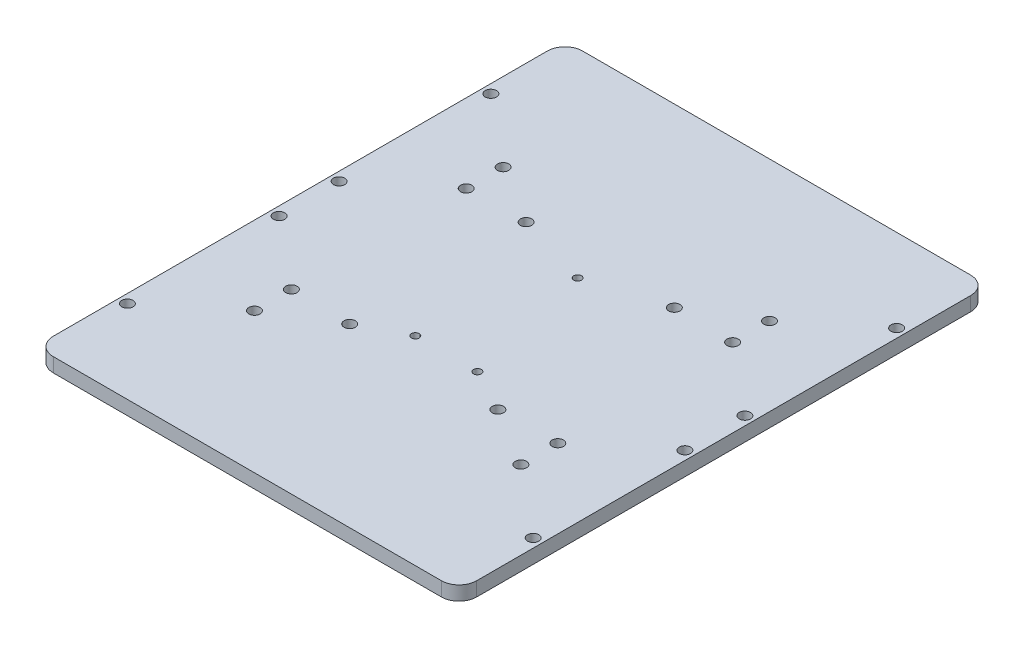
ISO-10303-21;
HEADER;
FILE_DESCRIPTION(('STEP AP214'),'2;1');
FILE_NAME('part.step','',(''),(''),'','','');
FILE_SCHEMA(('AUTOMOTIVE_DESIGN { 1 0 10303 214 1 1 1 1 }'));
ENDSEC;
DATA;
#1=APPLICATION_CONTEXT('core data for automotive mechanical design processes');
#2=APPLICATION_PROTOCOL_DEFINITION('international standard','automotive_design',2000,#1);
#3=PRODUCT_CONTEXT('',#1,'mechanical');
#4=PRODUCT('Part','Part','',(#3));
#5=PRODUCT_RELATED_PRODUCT_CATEGORY('part','',(#4));
#6=PRODUCT_DEFINITION_FORMATION('','',#4);
#7=PRODUCT_DEFINITION_CONTEXT('part definition',#1,'design');
#8=PRODUCT_DEFINITION('design','',#6,#7);
#9=PRODUCT_DEFINITION_SHAPE('','',#8);
#10=(LENGTH_UNIT() NAMED_UNIT(*) SI_UNIT(.MILLI.,.METRE.));
#11=(NAMED_UNIT(*) PLANE_ANGLE_UNIT() SI_UNIT($,.RADIAN.));
#12=(NAMED_UNIT(*) SI_UNIT($,.STERADIAN.) SOLID_ANGLE_UNIT());
#13=UNCERTAINTY_MEASURE_WITH_UNIT(LENGTH_MEASURE(1.E-05),#10,'distance_accuracy_value','');
#14=(GEOMETRIC_REPRESENTATION_CONTEXT(3) GLOBAL_UNCERTAINTY_ASSIGNED_CONTEXT((#13)) GLOBAL_UNIT_ASSIGNED_CONTEXT((#10,
#11,#12)) REPRESENTATION_CONTEXT('',''));
#15=CARTESIAN_POINT('',(0.,0.,0.));
#16=DIRECTION('',(0.,0.,1.));
#17=DIRECTION('',(1.,0.,0.));
#18=AXIS2_PLACEMENT_3D('',#15,#16,#17);
#19=CARTESIAN_POINT('',(0.,4.,0.));
#20=DIRECTION('',(0.,1.,0.));
#21=DIRECTION('',(0.,0.,1.));
#22=AXIS2_PLACEMENT_3D('',#19,#20,#21);
#23=PLANE('',#22);
#24=CARTESIAN_POINT('',(21.,4.,25.));
#25=DIRECTION('',(0.,1.,0.));
#26=DIRECTION('',(0.,0.,1.));
#27=AXIS2_PLACEMENT_3D('',#24,#25,#26);
#28=CIRCLE('',#27,1.6);
#29=CARTESIAN_POINT('',(21.,4.,26.6));
#30=VERTEX_POINT('',#29);
#31=EDGE_CURVE('E304',#30,#30,#28,.T.);
#32=ORIENTED_EDGE('',*,*,#31,.F.);
#33=EDGE_LOOP('',(#32));
#34=FACE_BOUND('',#33,.T.);
#35=CARTESIAN_POINT('',(-21.,4.,-25.));
#36=DIRECTION('',(0.,1.,0.));
#37=DIRECTION('',(0.,0.,1.));
#38=AXIS2_PLACEMENT_3D('',#35,#36,#37);
#39=CIRCLE('',#38,1.6);
#40=CARTESIAN_POINT('',(-21.,4.,-23.4));
#41=VERTEX_POINT('',#40);
#42=EDGE_CURVE('E292',#41,#41,#39,.T.);
#43=ORIENTED_EDGE('',*,*,#42,.F.);
#44=EDGE_LOOP('',(#43));
#45=FACE_BOUND('',#44,.T.);
#46=CARTESIAN_POINT('',(8.8,4.,18.6));
#47=DIRECTION('',(0.,1.,0.));
#48=DIRECTION('',(0.,0.,1.));
#49=AXIS2_PLACEMENT_3D('',#46,#47,#48);
#50=CIRCLE('',#49,1.1);
#51=CARTESIAN_POINT('',(8.8,4.,19.7));
#52=VERTEX_POINT('',#51);
#53=EDGE_CURVE('E280',#52,#52,#50,.T.);
#54=ORIENTED_EDGE('',*,*,#53,.F.);
#55=EDGE_LOOP('',(#54));
#56=FACE_BOUND('',#55,.T.);
#57=CARTESIAN_POINT('',(57.5,4.,-51.5));
#58=DIRECTION('',(0.,1.,0.));
#59=DIRECTION('',(0.,0.,-1.));
#60=AXIS2_PLACEMENT_3D('',#57,#58,#59);
#61=CIRCLE('',#60,1.6);
#62=CARTESIAN_POINT('',(57.5,4.,-53.1));
#63=VERTEX_POINT('',#62);
#64=EDGE_CURVE('E268',#63,#63,#61,.T.);
#65=ORIENTED_EDGE('',*,*,#64,.F.);
#66=EDGE_LOOP('',(#65));
#67=FACE_BOUND('',#66,.T.);
#68=CARTESIAN_POINT('',(37.75,4.,-24.77));
#69=DIRECTION('',(0.,1.,0.));
#70=DIRECTION('',(0.,0.,1.));
#71=AXIS2_PLACEMENT_3D('',#68,#69,#70);
#72=CIRCLE('',#71,1.6);
#73=CARTESIAN_POINT('',(37.75,4.,-23.17));
#74=VERTEX_POINT('',#73);
#75=EDGE_CURVE('E256',#74,#74,#72,.T.);
#76=ORIENTED_EDGE('',*,*,#75,.F.);
#77=EDGE_LOOP('',(#76));
#78=FACE_BOUND('',#77,.T.);
#79=CARTESIAN_POINT('',(57.5,4.,8.50000000000001));
#80=DIRECTION('',(0.,1.,0.));
#81=DIRECTION('',(0.,0.,-1.));
#82=AXIS2_PLACEMENT_3D('',#79,#80,#81);
#83=CIRCLE('',#82,1.6);
#84=CARTESIAN_POINT('',(57.5,4.,6.90000000000001));
#85=VERTEX_POINT('',#84);
#86=EDGE_CURVE('E244',#85,#85,#83,.T.);
#87=ORIENTED_EDGE('',*,*,#86,.F.);
#88=EDGE_LOOP('',(#87));
#89=FACE_BOUND('',#88,.T.);
#90=CARTESIAN_POINT('',(37.75,4.,35.23));
#91=DIRECTION('',(0.,1.,0.));
#92=DIRECTION('',(0.,0.,1.));
#93=AXIS2_PLACEMENT_3D('',#90,#91,#92);
#94=CIRCLE('',#93,1.6);
#95=CARTESIAN_POINT('',(37.75,4.,36.83));
#96=VERTEX_POINT('',#95);
#97=EDGE_CURVE('E232',#96,#96,#94,.T.);
#98=ORIENTED_EDGE('',*,*,#97,.F.);
#99=EDGE_LOOP('',(#98));
#100=FACE_BOUND('',#99,.T.);
#101=CARTESIAN_POINT('',(-57.5,4.,51.5));
#102=DIRECTION('',(0.,1.,0.));
#103=DIRECTION('',(0.,0.,-1.));
#104=AXIS2_PLACEMENT_3D('',#101,#102,#103);
#105=CIRCLE('',#104,1.6);
#106=CARTESIAN_POINT('',(-57.5,4.,49.9));
#107=VERTEX_POINT('',#106);
#108=EDGE_CURVE('E220',#107,#107,#105,.T.);
#109=ORIENTED_EDGE('',*,*,#108,.F.);
#110=EDGE_LOOP('',(#109));
#111=FACE_BOUND('',#110,.T.);
#112=CARTESIAN_POINT('',(-37.75,4.,24.77));
#113=DIRECTION('',(0.,1.,0.));
#114=DIRECTION('',(0.,0.,1.));
#115=AXIS2_PLACEMENT_3D('',#112,#113,#114);
#116=CIRCLE('',#115,1.6);
#117=CARTESIAN_POINT('',(-37.75,4.,26.37));
#118=VERTEX_POINT('',#117);
#119=EDGE_CURVE('E208',#118,#118,#116,.T.);
#120=ORIENTED_EDGE('',*,*,#119,.F.);
#121=EDGE_LOOP('',(#120));
#122=FACE_BOUND('',#121,.T.);
#123=CARTESIAN_POINT('',(-37.75,4.,-24.77));
#124=DIRECTION('',(0.,1.,0.));
#125=DIRECTION('',(0.,0.,-1.));
#126=AXIS2_PLACEMENT_3D('',#123,#124,#125);
#127=CIRCLE('',#126,1.6);
#128=CARTESIAN_POINT('',(-37.75,4.,-26.37));
#129=VERTEX_POINT('',#128);
#130=EDGE_CURVE('E196',#129,#129,#127,.T.);
#131=ORIENTED_EDGE('',*,*,#130,.F.);
#132=EDGE_LOOP('',(#131));
#133=FACE_BOUND('',#132,.T.);
#134=CARTESIAN_POINT('',(-57.5,4.,-8.49999999999999));
#135=DIRECTION('',(0.,1.,0.));
#136=DIRECTION('',(0.,0.,-1.));
#137=AXIS2_PLACEMENT_3D('',#134,#135,#136);
#138=CIRCLE('',#137,1.6);
#139=CARTESIAN_POINT('',(-57.5,4.,-10.1));
#140=VERTEX_POINT('',#139);
#141=EDGE_CURVE('E185',#140,#140,#138,.T.);
#142=ORIENTED_EDGE('',*,*,#141,.F.);
#143=EDGE_LOOP('',(#142));
#144=FACE_BOUND('',#143,.T.);
#145=DIRECTION('',(-1.,0.,0.));
#146=VECTOR('',#145,1.);
#147=CARTESIAN_POINT('',(-60.,4.,-75.));
#148=LINE('',#147,#146);
#149=CARTESIAN_POINT('',(55.,4.,-75.));
#150=VERTEX_POINT('',#149);
#151=CARTESIAN_POINT('',(-55.,4.,-75.));
#152=VERTEX_POINT('',#151);
#153=EDGE_CURVE('E171',#150,#152,#148,.T.);
#154=ORIENTED_EDGE('',*,*,#153,.T.);
#155=CARTESIAN_POINT('',(-55.,4.,-70.));
#156=DIRECTION('',(0.,1.,0.));
#157=DIRECTION('',(0.,0.,1.));
#158=AXIS2_PLACEMENT_3D('',#155,#156,#157);
#159=CIRCLE('',#158,5.);
#160=CARTESIAN_POINT('',(-60.,4.,-70.));
#161=VERTEX_POINT('',#160);
#162=EDGE_CURVE('E149',#152,#161,#159,.T.);
#163=ORIENTED_EDGE('',*,*,#162,.T.);
#164=DIRECTION('',(0.,0.,1.));
#165=VECTOR('',#164,1.);
#166=CARTESIAN_POINT('',(-60.,4.,-75.));
#167=LINE('',#166,#165);
#168=CARTESIAN_POINT('',(-60.,4.,70.));
#169=VERTEX_POINT('',#168);
#170=EDGE_CURVE('E119',#161,#169,#167,.T.);
#171=ORIENTED_EDGE('',*,*,#170,.T.);
#172=CARTESIAN_POINT('',(-55.,4.,70.));
#173=DIRECTION('',(0.,1.,0.));
#174=DIRECTION('',(0.,0.,1.));
#175=AXIS2_PLACEMENT_3D('',#172,#173,#174);
#176=CIRCLE('',#175,5.);
#177=CARTESIAN_POINT('',(-55.,4.,75.));
#178=VERTEX_POINT('',#177);
#179=EDGE_CURVE('E55',#169,#178,#176,.T.);
#180=ORIENTED_EDGE('',*,*,#179,.T.);
#181=DIRECTION('',(1.,0.,0.));
#182=VECTOR('',#181,1.);
#183=CARTESIAN_POINT('',(-60.,4.,75.));
#184=LINE('',#183,#182);
#185=CARTESIAN_POINT('',(55.,4.,75.));
#186=VERTEX_POINT('',#185);
#187=EDGE_CURVE('E135',#178,#186,#184,.T.);
#188=ORIENTED_EDGE('',*,*,#187,.T.);
#189=CARTESIAN_POINT('',(55.,4.,70.));
#190=DIRECTION('',(0.,1.,0.));
#191=DIRECTION('',(0.,0.,1.));
#192=AXIS2_PLACEMENT_3D('',#189,#190,#191);
#193=CIRCLE('',#192,5.);
#194=CARTESIAN_POINT('',(60.,4.,70.));
#195=VERTEX_POINT('',#194);
#196=EDGE_CURVE('E145',#186,#195,#193,.T.);
#197=ORIENTED_EDGE('',*,*,#196,.T.);
#198=DIRECTION('',(0.,0.,-1.));
#199=VECTOR('',#198,1.);
#200=CARTESIAN_POINT('',(60.,4.,-75.));
#201=LINE('',#200,#199);
#202=CARTESIAN_POINT('',(60.,4.,-70.));
#203=VERTEX_POINT('',#202);
#204=EDGE_CURVE('E129',#195,#203,#201,.T.);
#205=ORIENTED_EDGE('',*,*,#204,.T.);
#206=CARTESIAN_POINT('',(55.,4.,-70.));
#207=DIRECTION('',(0.,1.,0.));
#208=DIRECTION('',(0.,0.,1.));
#209=AXIS2_PLACEMENT_3D('',#206,#207,#208);
#210=CIRCLE('',#209,5.);
#211=EDGE_CURVE('E147',#203,#150,#210,.T.);
#212=ORIENTED_EDGE('',*,*,#211,.T.);
#213=EDGE_LOOP('',(#154,#163,#171,#180,#188,#197,#205,#212));
#214=FACE_BOUND('',#213,.T.);
#215=CARTESIAN_POINT('',(-57.5,4.,-51.5));
#216=DIRECTION('',(0.,1.,0.));
#217=DIRECTION('',(0.,0.,1.));
#218=AXIS2_PLACEMENT_3D('',#215,#216,#217);
#219=CIRCLE('',#218,1.6);
#220=CARTESIAN_POINT('',(-57.5,4.,-49.9));
#221=VERTEX_POINT('',#220);
#222=EDGE_CURVE('E180',#221,#221,#219,.T.);
#223=ORIENTED_EDGE('',*,*,#222,.F.);
#224=EDGE_LOOP('',(#223));
#225=FACE_BOUND('',#224,.T.);
#226=CARTESIAN_POINT('',(-37.75,4.,-35.23));
#227=DIRECTION('',(0.,1.,0.));
#228=DIRECTION('',(0.,0.,1.));
#229=AXIS2_PLACEMENT_3D('',#226,#227,#228);
#230=CIRCLE('',#229,1.6);
#231=CARTESIAN_POINT('',(-37.75,4.,-33.63));
#232=VERTEX_POINT('',#231);
#233=EDGE_CURVE('E190',#232,#232,#230,.T.);
#234=ORIENTED_EDGE('',*,*,#233,.F.);
#235=EDGE_LOOP('',(#234));
#236=FACE_BOUND('',#235,.T.);
#237=CARTESIAN_POINT('',(-57.5,4.,8.50000000000001));
#238=DIRECTION('',(0.,1.,0.));
#239=DIRECTION('',(0.,0.,1.));
#240=AXIS2_PLACEMENT_3D('',#237,#238,#239);
#241=CIRCLE('',#240,1.6);
#242=CARTESIAN_POINT('',(-57.5,4.,10.1));
#243=VERTEX_POINT('',#242);
#244=EDGE_CURVE('E202',#243,#243,#241,.T.);
#245=ORIENTED_EDGE('',*,*,#244,.F.);
#246=EDGE_LOOP('',(#245));
#247=FACE_BOUND('',#246,.T.);
#248=CARTESIAN_POINT('',(-37.75,4.,35.23));
#249=DIRECTION('',(0.,1.,0.));
#250=DIRECTION('',(0.,0.,-1.));
#251=AXIS2_PLACEMENT_3D('',#248,#249,#250);
#252=CIRCLE('',#251,1.6);
#253=CARTESIAN_POINT('',(-37.75,4.,33.63));
#254=VERTEX_POINT('',#253);
#255=EDGE_CURVE('E214',#254,#254,#252,.T.);
#256=ORIENTED_EDGE('',*,*,#255,.F.);
#257=EDGE_LOOP('',(#256));
#258=FACE_BOUND('',#257,.T.);
#259=CARTESIAN_POINT('',(57.5,4.,51.5));
#260=DIRECTION('',(0.,1.,0.));
#261=DIRECTION('',(0.,0.,1.));
#262=AXIS2_PLACEMENT_3D('',#259,#260,#261);
#263=CIRCLE('',#262,1.6);
#264=CARTESIAN_POINT('',(57.5,4.,53.1));
#265=VERTEX_POINT('',#264);
#266=EDGE_CURVE('E226',#265,#265,#263,.T.);
#267=ORIENTED_EDGE('',*,*,#266,.F.);
#268=EDGE_LOOP('',(#267));
#269=FACE_BOUND('',#268,.T.);
#270=CARTESIAN_POINT('',(37.75,4.,24.77));
#271=DIRECTION('',(0.,1.,0.));
#272=DIRECTION('',(0.,0.,-1.));
#273=AXIS2_PLACEMENT_3D('',#270,#271,#272);
#274=CIRCLE('',#273,1.6);
#275=CARTESIAN_POINT('',(37.75,4.,23.17));
#276=VERTEX_POINT('',#275);
#277=EDGE_CURVE('E238',#276,#276,#274,.T.);
#278=ORIENTED_EDGE('',*,*,#277,.F.);
#279=EDGE_LOOP('',(#278));
#280=FACE_BOUND('',#279,.T.);
#281=CARTESIAN_POINT('',(57.5,4.,-8.50000000000002));
#282=DIRECTION('',(0.,1.,0.));
#283=DIRECTION('',(0.,0.,1.));
#284=AXIS2_PLACEMENT_3D('',#281,#282,#283);
#285=CIRCLE('',#284,1.6);
#286=CARTESIAN_POINT('',(57.5,4.,-6.90000000000002));
#287=VERTEX_POINT('',#286);
#288=EDGE_CURVE('E250',#287,#287,#285,.T.);
#289=ORIENTED_EDGE('',*,*,#288,.F.);
#290=EDGE_LOOP('',(#289));
#291=FACE_BOUND('',#290,.T.);
#292=CARTESIAN_POINT('',(37.75,4.,-35.23));
#293=DIRECTION('',(0.,1.,0.));
#294=DIRECTION('',(0.,0.,-1.));
#295=AXIS2_PLACEMENT_3D('',#292,#293,#294);
#296=CIRCLE('',#295,1.6);
#297=CARTESIAN_POINT('',(37.75,4.,-36.83));
#298=VERTEX_POINT('',#297);
#299=EDGE_CURVE('E262',#298,#298,#296,.T.);
#300=ORIENTED_EDGE('',*,*,#299,.F.);
#301=EDGE_LOOP('',(#300));
#302=FACE_BOUND('',#301,.T.);
#303=CARTESIAN_POINT('',(0.,4.,-18.6));
#304=DIRECTION('',(0.,1.,0.));
#305=DIRECTION('',(0.,0.,1.));
#306=AXIS2_PLACEMENT_3D('',#303,#304,#305);
#307=CIRCLE('',#306,1.1);
#308=CARTESIAN_POINT('',(0.,4.,-17.5));
#309=VERTEX_POINT('',#308);
#310=EDGE_CURVE('E274',#309,#309,#307,.T.);
#311=ORIENTED_EDGE('',*,*,#310,.F.);
#312=EDGE_LOOP('',(#311));
#313=FACE_BOUND('',#312,.T.);
#314=CARTESIAN_POINT('',(-8.8,4.,18.6));
#315=DIRECTION('',(0.,1.,0.));
#316=DIRECTION('',(0.,0.,1.));
#317=AXIS2_PLACEMENT_3D('',#314,#315,#316);
#318=CIRCLE('',#317,1.1);
#319=CARTESIAN_POINT('',(-8.8,4.,19.7));
#320=VERTEX_POINT('',#319);
#321=EDGE_CURVE('E286',#320,#320,#318,.T.);
#322=ORIENTED_EDGE('',*,*,#321,.F.);
#323=EDGE_LOOP('',(#322));
#324=FACE_BOUND('',#323,.T.);
#325=CARTESIAN_POINT('',(21.,4.,-25.));
#326=DIRECTION('',(0.,1.,0.));
#327=DIRECTION('',(0.,0.,-1.));
#328=AXIS2_PLACEMENT_3D('',#325,#326,#327);
#329=CIRCLE('',#328,1.6);
#330=CARTESIAN_POINT('',(21.,4.,-26.6));
#331=VERTEX_POINT('',#330);
#332=EDGE_CURVE('E298',#331,#331,#329,.T.);
#333=ORIENTED_EDGE('',*,*,#332,.F.);
#334=EDGE_LOOP('',(#333));
#335=FACE_BOUND('',#334,.T.);
#336=CARTESIAN_POINT('',(-21.,4.,25.));
#337=DIRECTION('',(0.,1.,0.));
#338=DIRECTION('',(0.,0.,-1.));
#339=AXIS2_PLACEMENT_3D('',#336,#337,#338);
#340=CIRCLE('',#339,1.6);
#341=CARTESIAN_POINT('',(-21.,4.,23.4));
#342=VERTEX_POINT('',#341);
#343=EDGE_CURVE('E310',#342,#342,#340,.T.);
#344=ORIENTED_EDGE('',*,*,#343,.F.);
#345=EDGE_LOOP('',(#344));
#346=FACE_BOUND('',#345,.T.);
#347=ADVANCED_FACE('F35',(#34,#45,#56,#67,#78,#89,#100,#111,#122,#133,#144,#214,#225,#236,#247,
#258,#269,#280,#291,#302,#313,#324,#335,#346),#23,.T.);
#348=CARTESIAN_POINT('',(0.,0.,0.));
#349=DIRECTION('',(0.,1.,0.));
#350=DIRECTION('',(0.,0.,1.));
#351=AXIS2_PLACEMENT_3D('',#348,#349,#350);
#352=PLANE('',#351);
#353=DIRECTION('',(0.,0.,1.));
#354=VECTOR('',#353,1.);
#355=CARTESIAN_POINT('',(-60.,0.,-75.));
#356=LINE('',#355,#354);
#357=CARTESIAN_POINT('',(-60.,0.,-70.));
#358=VERTEX_POINT('',#357);
#359=CARTESIAN_POINT('',(-60.,0.,70.));
#360=VERTEX_POINT('',#359);
#361=EDGE_CURVE('E117',#358,#360,#356,.T.);
#362=ORIENTED_EDGE('',*,*,#361,.F.);
#363=CARTESIAN_POINT('',(-55.,0.,-70.));
#364=DIRECTION('',(0.,1.,0.));
#365=DIRECTION('',(0.,0.,1.));
#366=AXIS2_PLACEMENT_3D('',#363,#364,#365);
#367=CIRCLE('',#366,5.);
#368=CARTESIAN_POINT('',(-55.,0.,-75.));
#369=VERTEX_POINT('',#368);
#370=EDGE_CURVE('E100',#358,#369,#367,.F.);
#371=ORIENTED_EDGE('',*,*,#370,.T.);
#372=DIRECTION('',(-1.,0.,0.));
#373=VECTOR('',#372,1.);
#374=CARTESIAN_POINT('',(-60.,0.,-75.));
#375=LINE('',#374,#373);
#376=CARTESIAN_POINT('',(55.,0.,-75.));
#377=VERTEX_POINT('',#376);
#378=EDGE_CURVE('E127',#377,#369,#375,.T.);
#379=ORIENTED_EDGE('',*,*,#378,.F.);
#380=CARTESIAN_POINT('',(55.,0.,-70.));
#381=DIRECTION('',(0.,1.,0.));
#382=DIRECTION('',(0.,0.,1.));
#383=AXIS2_PLACEMENT_3D('',#380,#381,#382);
#384=CIRCLE('',#383,5.);
#385=CARTESIAN_POINT('',(60.,0.,-70.));
#386=VERTEX_POINT('',#385);
#387=EDGE_CURVE('E111',#377,#386,#384,.F.);
#388=ORIENTED_EDGE('',*,*,#387,.T.);
#389=DIRECTION('',(0.,0.,-1.));
#390=VECTOR('',#389,1.);
#391=CARTESIAN_POINT('',(60.,0.,-75.));
#392=LINE('',#391,#390);
#393=CARTESIAN_POINT('',(60.,0.,70.));
#394=VERTEX_POINT('',#393);
#395=EDGE_CURVE('E131',#394,#386,#392,.T.);
#396=ORIENTED_EDGE('',*,*,#395,.F.);
#397=CARTESIAN_POINT('',(55.,0.,70.));
#398=DIRECTION('',(0.,1.,0.));
#399=DIRECTION('',(0.,0.,1.));
#400=AXIS2_PLACEMENT_3D('',#397,#398,#399);
#401=CIRCLE('',#400,5.);
#402=CARTESIAN_POINT('',(55.,0.,75.));
#403=VERTEX_POINT('',#402);
#404=EDGE_CURVE('E138',#394,#403,#401,.F.);
#405=ORIENTED_EDGE('',*,*,#404,.T.);
#406=DIRECTION('',(1.,0.,0.));
#407=VECTOR('',#406,1.);
#408=CARTESIAN_POINT('',(-60.,0.,75.));
#409=LINE('',#408,#407);
#410=CARTESIAN_POINT('',(-55.,0.,75.));
#411=VERTEX_POINT('',#410);
#412=EDGE_CURVE('E126',#411,#403,#409,.T.);
#413=ORIENTED_EDGE('',*,*,#412,.F.);
#414=CARTESIAN_POINT('',(-55.,0.,70.));
#415=DIRECTION('',(0.,1.,0.));
#416=DIRECTION('',(0.,0.,1.));
#417=AXIS2_PLACEMENT_3D('',#414,#415,#416);
#418=CIRCLE('',#417,5.);
#419=EDGE_CURVE('E120',#411,#360,#418,.F.);
#420=ORIENTED_EDGE('',*,*,#419,.T.);
#421=EDGE_LOOP('',(#362,#371,#379,#388,#396,#405,#413,#420));
#422=FACE_BOUND('',#421,.T.);
#423=CARTESIAN_POINT('',(-57.5,0.,-51.5));
#424=DIRECTION('',(0.,1.,0.));
#425=DIRECTION('',(0.,0.,1.));
#426=AXIS2_PLACEMENT_3D('',#423,#424,#425);
#427=CIRCLE('',#426,1.6);
#428=CARTESIAN_POINT('',(-57.5,0.,-49.9));
#429=VERTEX_POINT('',#428);
#430=EDGE_CURVE('E176',#429,#429,#427,.T.);
#431=ORIENTED_EDGE('',*,*,#430,.T.);
#432=EDGE_LOOP('',(#431));
#433=FACE_BOUND('',#432,.T.);
#434=CARTESIAN_POINT('',(-57.5,0.,-8.49999999999999));
#435=DIRECTION('',(0.,1.,0.));
#436=DIRECTION('',(0.,0.,-1.));
#437=AXIS2_PLACEMENT_3D('',#434,#435,#436);
#438=CIRCLE('',#437,1.6);
#439=CARTESIAN_POINT('',(-57.5,0.,-10.1));
#440=VERTEX_POINT('',#439);
#441=EDGE_CURVE('E187',#440,#440,#438,.T.);
#442=ORIENTED_EDGE('',*,*,#441,.T.);
#443=EDGE_LOOP('',(#442));
#444=FACE_BOUND('',#443,.T.);
#445=CARTESIAN_POINT('',(-37.75,0.,-35.23));
#446=DIRECTION('',(0.,1.,0.));
#447=DIRECTION('',(0.,0.,1.));
#448=AXIS2_PLACEMENT_3D('',#445,#446,#447);
#449=CIRCLE('',#448,1.6);
#450=CARTESIAN_POINT('',(-37.75,0.,-33.63));
#451=VERTEX_POINT('',#450);
#452=EDGE_CURVE('E193',#451,#451,#449,.T.);
#453=ORIENTED_EDGE('',*,*,#452,.T.);
#454=EDGE_LOOP('',(#453));
#455=FACE_BOUND('',#454,.T.);
#456=CARTESIAN_POINT('',(-37.75,0.,-24.77));
#457=DIRECTION('',(0.,1.,0.));
#458=DIRECTION('',(0.,0.,-1.));
#459=AXIS2_PLACEMENT_3D('',#456,#457,#458);
#460=CIRCLE('',#459,1.6);
#461=CARTESIAN_POINT('',(-37.75,0.,-26.37));
#462=VERTEX_POINT('',#461);
#463=EDGE_CURVE('E199',#462,#462,#460,.T.);
#464=ORIENTED_EDGE('',*,*,#463,.T.);
#465=EDGE_LOOP('',(#464));
#466=FACE_BOUND('',#465,.T.);
#467=CARTESIAN_POINT('',(-57.5,0.,8.50000000000001));
#468=DIRECTION('',(0.,1.,0.));
#469=DIRECTION('',(0.,0.,1.));
#470=AXIS2_PLACEMENT_3D('',#467,#468,#469);
#471=CIRCLE('',#470,1.6);
#472=CARTESIAN_POINT('',(-57.5,0.,10.1));
#473=VERTEX_POINT('',#472);
#474=EDGE_CURVE('E205',#473,#473,#471,.T.);
#475=ORIENTED_EDGE('',*,*,#474,.T.);
#476=EDGE_LOOP('',(#475));
#477=FACE_BOUND('',#476,.T.);
#478=CARTESIAN_POINT('',(-37.75,0.,24.77));
#479=DIRECTION('',(0.,1.,0.));
#480=DIRECTION('',(0.,0.,1.));
#481=AXIS2_PLACEMENT_3D('',#478,#479,#480);
#482=CIRCLE('',#481,1.6);
#483=CARTESIAN_POINT('',(-37.75,0.,26.37));
#484=VERTEX_POINT('',#483);
#485=EDGE_CURVE('E211',#484,#484,#482,.T.);
#486=ORIENTED_EDGE('',*,*,#485,.T.);
#487=EDGE_LOOP('',(#486));
#488=FACE_BOUND('',#487,.T.);
#489=CARTESIAN_POINT('',(-37.75,0.,35.23));
#490=DIRECTION('',(0.,1.,0.));
#491=DIRECTION('',(0.,0.,-1.));
#492=AXIS2_PLACEMENT_3D('',#489,#490,#491);
#493=CIRCLE('',#492,1.6);
#494=CARTESIAN_POINT('',(-37.75,0.,33.63));
#495=VERTEX_POINT('',#494);
#496=EDGE_CURVE('E217',#495,#495,#493,.T.);
#497=ORIENTED_EDGE('',*,*,#496,.T.);
#498=EDGE_LOOP('',(#497));
#499=FACE_BOUND('',#498,.T.);
#500=CARTESIAN_POINT('',(-57.5,0.,51.5));
#501=DIRECTION('',(0.,1.,0.));
#502=DIRECTION('',(0.,0.,-1.));
#503=AXIS2_PLACEMENT_3D('',#500,#501,#502);
#504=CIRCLE('',#503,1.6);
#505=CARTESIAN_POINT('',(-57.5,0.,49.9));
#506=VERTEX_POINT('',#505);
#507=EDGE_CURVE('E223',#506,#506,#504,.T.);
#508=ORIENTED_EDGE('',*,*,#507,.T.);
#509=EDGE_LOOP('',(#508));
#510=FACE_BOUND('',#509,.T.);
#511=CARTESIAN_POINT('',(57.5,0.,51.5));
#512=DIRECTION('',(0.,1.,0.));
#513=DIRECTION('',(0.,0.,1.));
#514=AXIS2_PLACEMENT_3D('',#511,#512,#513);
#515=CIRCLE('',#514,1.6);
#516=CARTESIAN_POINT('',(57.5,0.,53.1));
#517=VERTEX_POINT('',#516);
#518=EDGE_CURVE('E229',#517,#517,#515,.T.);
#519=ORIENTED_EDGE('',*,*,#518,.T.);
#520=EDGE_LOOP('',(#519));
#521=FACE_BOUND('',#520,.T.);
#522=CARTESIAN_POINT('',(37.75,0.,35.23));
#523=DIRECTION('',(0.,1.,0.));
#524=DIRECTION('',(0.,0.,1.));
#525=AXIS2_PLACEMENT_3D('',#522,#523,#524);
#526=CIRCLE('',#525,1.6);
#527=CARTESIAN_POINT('',(37.75,0.,36.83));
#528=VERTEX_POINT('',#527);
#529=EDGE_CURVE('E235',#528,#528,#526,.T.);
#530=ORIENTED_EDGE('',*,*,#529,.T.);
#531=EDGE_LOOP('',(#530));
#532=FACE_BOUND('',#531,.T.);
#533=CARTESIAN_POINT('',(37.75,0.,24.77));
#534=DIRECTION('',(0.,1.,0.));
#535=DIRECTION('',(0.,0.,-1.));
#536=AXIS2_PLACEMENT_3D('',#533,#534,#535);
#537=CIRCLE('',#536,1.6);
#538=CARTESIAN_POINT('',(37.75,0.,23.17));
#539=VERTEX_POINT('',#538);
#540=EDGE_CURVE('E241',#539,#539,#537,.T.);
#541=ORIENTED_EDGE('',*,*,#540,.T.);
#542=EDGE_LOOP('',(#541));
#543=FACE_BOUND('',#542,.T.);
#544=CARTESIAN_POINT('',(57.5,0.,8.50000000000001));
#545=DIRECTION('',(0.,1.,0.));
#546=DIRECTION('',(0.,0.,-1.));
#547=AXIS2_PLACEMENT_3D('',#544,#545,#546);
#548=CIRCLE('',#547,1.6);
#549=CARTESIAN_POINT('',(57.5,0.,6.90000000000001));
#550=VERTEX_POINT('',#549);
#551=EDGE_CURVE('E247',#550,#550,#548,.T.);
#552=ORIENTED_EDGE('',*,*,#551,.T.);
#553=EDGE_LOOP('',(#552));
#554=FACE_BOUND('',#553,.T.);
#555=CARTESIAN_POINT('',(57.5,0.,-8.50000000000002));
#556=DIRECTION('',(0.,1.,0.));
#557=DIRECTION('',(0.,0.,1.));
#558=AXIS2_PLACEMENT_3D('',#555,#556,#557);
#559=CIRCLE('',#558,1.6);
#560=CARTESIAN_POINT('',(57.5,0.,-6.90000000000002));
#561=VERTEX_POINT('',#560);
#562=EDGE_CURVE('E253',#561,#561,#559,.T.);
#563=ORIENTED_EDGE('',*,*,#562,.T.);
#564=EDGE_LOOP('',(#563));
#565=FACE_BOUND('',#564,.T.);
#566=CARTESIAN_POINT('',(37.75,0.,-24.77));
#567=DIRECTION('',(0.,1.,0.));
#568=DIRECTION('',(0.,0.,1.));
#569=AXIS2_PLACEMENT_3D('',#566,#567,#568);
#570=CIRCLE('',#569,1.6);
#571=CARTESIAN_POINT('',(37.75,0.,-23.17));
#572=VERTEX_POINT('',#571);
#573=EDGE_CURVE('E259',#572,#572,#570,.T.);
#574=ORIENTED_EDGE('',*,*,#573,.T.);
#575=EDGE_LOOP('',(#574));
#576=FACE_BOUND('',#575,.T.);
#577=CARTESIAN_POINT('',(37.75,0.,-35.23));
#578=DIRECTION('',(0.,1.,0.));
#579=DIRECTION('',(0.,0.,-1.));
#580=AXIS2_PLACEMENT_3D('',#577,#578,#579);
#581=CIRCLE('',#580,1.6);
#582=CARTESIAN_POINT('',(37.75,0.,-36.83));
#583=VERTEX_POINT('',#582);
#584=EDGE_CURVE('E265',#583,#583,#581,.T.);
#585=ORIENTED_EDGE('',*,*,#584,.T.);
#586=EDGE_LOOP('',(#585));
#587=FACE_BOUND('',#586,.T.);
#588=CARTESIAN_POINT('',(57.5,0.,-51.5));
#589=DIRECTION('',(0.,1.,0.));
#590=DIRECTION('',(0.,0.,-1.));
#591=AXIS2_PLACEMENT_3D('',#588,#589,#590);
#592=CIRCLE('',#591,1.6);
#593=CARTESIAN_POINT('',(57.5,0.,-53.1));
#594=VERTEX_POINT('',#593);
#595=EDGE_CURVE('E271',#594,#594,#592,.T.);
#596=ORIENTED_EDGE('',*,*,#595,.T.);
#597=EDGE_LOOP('',(#596));
#598=FACE_BOUND('',#597,.T.);
#599=CARTESIAN_POINT('',(0.,0.,-18.6));
#600=DIRECTION('',(0.,1.,0.));
#601=DIRECTION('',(0.,0.,1.));
#602=AXIS2_PLACEMENT_3D('',#599,#600,#601);
#603=CIRCLE('',#602,1.1);
#604=CARTESIAN_POINT('',(0.,0.,-17.5));
#605=VERTEX_POINT('',#604);
#606=EDGE_CURVE('E277',#605,#605,#603,.T.);
#607=ORIENTED_EDGE('',*,*,#606,.T.);
#608=EDGE_LOOP('',(#607));
#609=FACE_BOUND('',#608,.T.);
#610=CARTESIAN_POINT('',(8.8,0.,18.6));
#611=DIRECTION('',(0.,1.,0.));
#612=DIRECTION('',(0.,0.,1.));
#613=AXIS2_PLACEMENT_3D('',#610,#611,#612);
#614=CIRCLE('',#613,1.1);
#615=CARTESIAN_POINT('',(8.8,0.,19.7));
#616=VERTEX_POINT('',#615);
#617=EDGE_CURVE('E283',#616,#616,#614,.T.);
#618=ORIENTED_EDGE('',*,*,#617,.T.);
#619=EDGE_LOOP('',(#618));
#620=FACE_BOUND('',#619,.T.);
#621=CARTESIAN_POINT('',(-8.8,0.,18.6));
#622=DIRECTION('',(0.,1.,0.));
#623=DIRECTION('',(0.,0.,1.));
#624=AXIS2_PLACEMENT_3D('',#621,#622,#623);
#625=CIRCLE('',#624,1.1);
#626=CARTESIAN_POINT('',(-8.8,0.,19.7));
#627=VERTEX_POINT('',#626);
#628=EDGE_CURVE('E289',#627,#627,#625,.T.);
#629=ORIENTED_EDGE('',*,*,#628,.T.);
#630=EDGE_LOOP('',(#629));
#631=FACE_BOUND('',#630,.T.);
#632=CARTESIAN_POINT('',(-21.,0.,-25.));
#633=DIRECTION('',(0.,1.,0.));
#634=DIRECTION('',(0.,0.,1.));
#635=AXIS2_PLACEMENT_3D('',#632,#633,#634);
#636=CIRCLE('',#635,1.6);
#637=CARTESIAN_POINT('',(-21.,0.,-23.4));
#638=VERTEX_POINT('',#637);
#639=EDGE_CURVE('E295',#638,#638,#636,.T.);
#640=ORIENTED_EDGE('',*,*,#639,.T.);
#641=EDGE_LOOP('',(#640));
#642=FACE_BOUND('',#641,.T.);
#643=CARTESIAN_POINT('',(21.,0.,-25.));
#644=DIRECTION('',(0.,1.,0.));
#645=DIRECTION('',(0.,0.,-1.));
#646=AXIS2_PLACEMENT_3D('',#643,#644,#645);
#647=CIRCLE('',#646,1.6);
#648=CARTESIAN_POINT('',(21.,0.,-26.6));
#649=VERTEX_POINT('',#648);
#650=EDGE_CURVE('E301',#649,#649,#647,.T.);
#651=ORIENTED_EDGE('',*,*,#650,.T.);
#652=EDGE_LOOP('',(#651));
#653=FACE_BOUND('',#652,.T.);
#654=CARTESIAN_POINT('',(21.,0.,25.));
#655=DIRECTION('',(0.,1.,0.));
#656=DIRECTION('',(0.,0.,1.));
#657=AXIS2_PLACEMENT_3D('',#654,#655,#656);
#658=CIRCLE('',#657,1.6);
#659=CARTESIAN_POINT('',(21.,0.,26.6));
#660=VERTEX_POINT('',#659);
#661=EDGE_CURVE('E307',#660,#660,#658,.T.);
#662=ORIENTED_EDGE('',*,*,#661,.T.);
#663=EDGE_LOOP('',(#662));
#664=FACE_BOUND('',#663,.T.);
#665=CARTESIAN_POINT('',(-21.,0.,25.));
#666=DIRECTION('',(0.,1.,0.));
#667=DIRECTION('',(0.,0.,-1.));
#668=AXIS2_PLACEMENT_3D('',#665,#666,#667);
#669=CIRCLE('',#668,1.6);
#670=CARTESIAN_POINT('',(-21.,0.,23.4));
#671=VERTEX_POINT('',#670);
#672=EDGE_CURVE('E313',#671,#671,#669,.T.);
#673=ORIENTED_EDGE('',*,*,#672,.T.);
#674=EDGE_LOOP('',(#673));
#675=FACE_BOUND('',#674,.T.);
#676=ADVANCED_FACE('F123',(#422,#433,#444,#455,#466,#477,#488,#499,#510,#521,#532,#543,#554,
#565,#576,#587,#598,#609,#620,#631,#642,#653,#664,#675),#352,.F.);
#677=CARTESIAN_POINT('',(60.,4.,-75.));
#678=DIRECTION('',(-1.,0.,0.));
#679=DIRECTION('',(0.,0.,1.));
#680=AXIS2_PLACEMENT_3D('',#677,#678,#679);
#681=PLANE('',#680);
#682=ORIENTED_EDGE('',*,*,#395,.T.);
#683=DIRECTION('',(0.,-1.,0.));
#684=VECTOR('',#683,1.);
#685=CARTESIAN_POINT('',(60.,4.,-70.));
#686=LINE('',#685,#684);
#687=EDGE_CURVE('E154',#386,#203,#686,.F.);
#688=ORIENTED_EDGE('',*,*,#687,.T.);
#689=ORIENTED_EDGE('',*,*,#204,.F.);
#690=DIRECTION('',(0.,-1.,0.));
#691=VECTOR('',#690,1.);
#692=CARTESIAN_POINT('',(60.,4.,70.));
#693=LINE('',#692,#691);
#694=EDGE_CURVE('E151',#195,#394,#693,.T.);
#695=ORIENTED_EDGE('',*,*,#694,.T.);
#696=EDGE_LOOP('',(#682,#688,#689,#695));
#697=FACE_BOUND('',#696,.T.);
#698=ADVANCED_FACE('F167',(#697),#681,.F.);
#699=CARTESIAN_POINT('',(-60.,4.,-75.));
#700=DIRECTION('',(0.,0.,1.));
#701=DIRECTION('',(1.,0.,0.));
#702=AXIS2_PLACEMENT_3D('',#699,#700,#701);
#703=PLANE('',#702);
#704=ORIENTED_EDGE('',*,*,#378,.T.);
#705=DIRECTION('',(0.,-1.,0.));
#706=VECTOR('',#705,1.);
#707=CARTESIAN_POINT('',(-55.,4.,-75.));
#708=LINE('',#707,#706);
#709=EDGE_CURVE('E105',#369,#152,#708,.F.);
#710=ORIENTED_EDGE('',*,*,#709,.T.);
#711=ORIENTED_EDGE('',*,*,#153,.F.);
#712=DIRECTION('',(0.,-1.,0.));
#713=VECTOR('',#712,1.);
#714=CARTESIAN_POINT('',(55.,4.,-75.));
#715=LINE('',#714,#713);
#716=EDGE_CURVE('E110',#150,#377,#715,.T.);
#717=ORIENTED_EDGE('',*,*,#716,.T.);
#718=EDGE_LOOP('',(#704,#710,#711,#717));
#719=FACE_BOUND('',#718,.T.);
#720=ADVANCED_FACE('F339',(#719),#703,.F.);
#721=CARTESIAN_POINT('',(-60.,4.,-75.));
#722=DIRECTION('',(1.,0.,0.));
#723=DIRECTION('',(0.,0.,-1.));
#724=AXIS2_PLACEMENT_3D('',#721,#722,#723);
#725=PLANE('',#724);
#726=ORIENTED_EDGE('',*,*,#170,.F.);
#727=DIRECTION('',(0.,-1.,0.));
#728=VECTOR('',#727,1.);
#729=CARTESIAN_POINT('',(-60.,4.,-70.));
#730=LINE('',#729,#728);
#731=EDGE_CURVE('E104',#161,#358,#730,.T.);
#732=ORIENTED_EDGE('',*,*,#731,.T.);
#733=ORIENTED_EDGE('',*,*,#361,.T.);
#734=DIRECTION('',(0.,-1.,0.));
#735=VECTOR('',#734,1.);
#736=CARTESIAN_POINT('',(-60.,4.,70.));
#737=LINE('',#736,#735);
#738=EDGE_CURVE('E121',#360,#169,#737,.F.);
#739=ORIENTED_EDGE('',*,*,#738,.T.);
#740=EDGE_LOOP('',(#726,#732,#733,#739));
#741=FACE_BOUND('',#740,.T.);
#742=ADVANCED_FACE('F116',(#741),#725,.F.);
#743=CARTESIAN_POINT('',(-60.,4.,75.));
#744=DIRECTION('',(0.,0.,-1.));
#745=DIRECTION('',(-1.,0.,0.));
#746=AXIS2_PLACEMENT_3D('',#743,#744,#745);
#747=PLANE('',#746);
#748=ORIENTED_EDGE('',*,*,#412,.T.);
#749=DIRECTION('',(0.,-1.,0.));
#750=VECTOR('',#749,1.);
#751=CARTESIAN_POINT('',(55.,4.,75.));
#752=LINE('',#751,#750);
#753=EDGE_CURVE('E11',#403,#186,#752,.F.);
#754=ORIENTED_EDGE('',*,*,#753,.T.);
#755=ORIENTED_EDGE('',*,*,#187,.F.);
#756=DIRECTION('',(0.,-1.,0.));
#757=VECTOR('',#756,1.);
#758=CARTESIAN_POINT('',(-55.,4.,75.));
#759=LINE('',#758,#757);
#760=EDGE_CURVE('E43',#178,#411,#759,.T.);
#761=ORIENTED_EDGE('',*,*,#760,.T.);
#762=EDGE_LOOP('',(#748,#754,#755,#761));
#763=FACE_BOUND('',#762,.T.);
#764=ADVANCED_FACE('F157',(#763),#747,.F.);
#765=CARTESIAN_POINT('',(-57.5,4.,-51.5));
#766=DIRECTION('',(0.,-1.,0.));
#767=DIRECTION('',(0.,0.,-1.));
#768=AXIS2_PLACEMENT_3D('',#765,#766,#767);
#769=CYLINDRICAL_SURFACE('',#768,1.6);
#770=ORIENTED_EDGE('',*,*,#222,.T.);
#771=EDGE_LOOP('',(#770));
#772=FACE_BOUND('',#771,.T.);
#773=ORIENTED_EDGE('',*,*,#430,.F.);
#774=EDGE_LOOP('',(#773));
#775=FACE_BOUND('',#774,.T.);
#776=ADVANCED_FACE('F332',(#772,#775),#769,.F.);
#777=CARTESIAN_POINT('',(-57.5,4.,-8.49999999999999));
#778=DIRECTION('',(0.,-1.,0.));
#779=DIRECTION('',(0.,0.,-1.));
#780=AXIS2_PLACEMENT_3D('',#777,#778,#779);
#781=CYLINDRICAL_SURFACE('',#780,1.6);
#782=ORIENTED_EDGE('',*,*,#141,.T.);
#783=EDGE_LOOP('',(#782));
#784=FACE_BOUND('',#783,.T.);
#785=ORIENTED_EDGE('',*,*,#441,.F.);
#786=EDGE_LOOP('',(#785));
#787=FACE_BOUND('',#786,.T.);
#788=ADVANCED_FACE('F469',(#784,#787),#781,.F.);
#789=CARTESIAN_POINT('',(-37.75,4.,-35.23));
#790=DIRECTION('',(0.,-1.,0.));
#791=DIRECTION('',(0.,0.,-1.));
#792=AXIS2_PLACEMENT_3D('',#789,#790,#791);
#793=CYLINDRICAL_SURFACE('',#792,1.6);
#794=ORIENTED_EDGE('',*,*,#233,.T.);
#795=EDGE_LOOP('',(#794));
#796=FACE_BOUND('',#795,.T.);
#797=ORIENTED_EDGE('',*,*,#452,.F.);
#798=EDGE_LOOP('',(#797));
#799=FACE_BOUND('',#798,.T.);
#800=ADVANCED_FACE('F466',(#796,#799),#793,.F.);
#801=CARTESIAN_POINT('',(-37.75,4.,-24.77));
#802=DIRECTION('',(0.,-1.,0.));
#803=DIRECTION('',(0.,0.,-1.));
#804=AXIS2_PLACEMENT_3D('',#801,#802,#803);
#805=CYLINDRICAL_SURFACE('',#804,1.6);
#806=ORIENTED_EDGE('',*,*,#130,.T.);
#807=EDGE_LOOP('',(#806));
#808=FACE_BOUND('',#807,.T.);
#809=ORIENTED_EDGE('',*,*,#463,.F.);
#810=EDGE_LOOP('',(#809));
#811=FACE_BOUND('',#810,.T.);
#812=ADVANCED_FACE('F462',(#808,#811),#805,.F.);
#813=CARTESIAN_POINT('',(-57.5,4.,8.50000000000001));
#814=DIRECTION('',(0.,-1.,0.));
#815=DIRECTION('',(0.,0.,-1.));
#816=AXIS2_PLACEMENT_3D('',#813,#814,#815);
#817=CYLINDRICAL_SURFACE('',#816,1.6);
#818=ORIENTED_EDGE('',*,*,#244,.T.);
#819=EDGE_LOOP('',(#818));
#820=FACE_BOUND('',#819,.T.);
#821=ORIENTED_EDGE('',*,*,#474,.F.);
#822=EDGE_LOOP('',(#821));
#823=FACE_BOUND('',#822,.T.);
#824=ADVANCED_FACE('F458',(#820,#823),#817,.F.);
#825=CARTESIAN_POINT('',(-37.75,4.,24.77));
#826=DIRECTION('',(0.,-1.,0.));
#827=DIRECTION('',(0.,0.,-1.));
#828=AXIS2_PLACEMENT_3D('',#825,#826,#827);
#829=CYLINDRICAL_SURFACE('',#828,1.6);
#830=ORIENTED_EDGE('',*,*,#119,.T.);
#831=EDGE_LOOP('',(#830));
#832=FACE_BOUND('',#831,.T.);
#833=ORIENTED_EDGE('',*,*,#485,.F.);
#834=EDGE_LOOP('',(#833));
#835=FACE_BOUND('',#834,.T.);
#836=ADVANCED_FACE('F454',(#832,#835),#829,.F.);
#837=CARTESIAN_POINT('',(-37.75,4.,35.23));
#838=DIRECTION('',(0.,-1.,0.));
#839=DIRECTION('',(0.,0.,-1.));
#840=AXIS2_PLACEMENT_3D('',#837,#838,#839);
#841=CYLINDRICAL_SURFACE('',#840,1.6);
#842=ORIENTED_EDGE('',*,*,#255,.T.);
#843=EDGE_LOOP('',(#842));
#844=FACE_BOUND('',#843,.T.);
#845=ORIENTED_EDGE('',*,*,#496,.F.);
#846=EDGE_LOOP('',(#845));
#847=FACE_BOUND('',#846,.T.);
#848=ADVANCED_FACE('F450',(#844,#847),#841,.F.);
#849=CARTESIAN_POINT('',(-57.5,4.,51.5));
#850=DIRECTION('',(0.,-1.,0.));
#851=DIRECTION('',(0.,0.,-1.));
#852=AXIS2_PLACEMENT_3D('',#849,#850,#851);
#853=CYLINDRICAL_SURFACE('',#852,1.6);
#854=ORIENTED_EDGE('',*,*,#108,.T.);
#855=EDGE_LOOP('',(#854));
#856=FACE_BOUND('',#855,.T.);
#857=ORIENTED_EDGE('',*,*,#507,.F.);
#858=EDGE_LOOP('',(#857));
#859=FACE_BOUND('',#858,.T.);
#860=ADVANCED_FACE('F446',(#856,#859),#853,.F.);
#861=CARTESIAN_POINT('',(57.5,4.,51.5));
#862=DIRECTION('',(0.,-1.,0.));
#863=DIRECTION('',(0.,0.,-1.));
#864=AXIS2_PLACEMENT_3D('',#861,#862,#863);
#865=CYLINDRICAL_SURFACE('',#864,1.6);
#866=ORIENTED_EDGE('',*,*,#266,.T.);
#867=EDGE_LOOP('',(#866));
#868=FACE_BOUND('',#867,.T.);
#869=ORIENTED_EDGE('',*,*,#518,.F.);
#870=EDGE_LOOP('',(#869));
#871=FACE_BOUND('',#870,.T.);
#872=ADVANCED_FACE('F442',(#868,#871),#865,.F.);
#873=CARTESIAN_POINT('',(37.75,4.,35.23));
#874=DIRECTION('',(0.,-1.,0.));
#875=DIRECTION('',(0.,0.,-1.));
#876=AXIS2_PLACEMENT_3D('',#873,#874,#875);
#877=CYLINDRICAL_SURFACE('',#876,1.6);
#878=ORIENTED_EDGE('',*,*,#97,.T.);
#879=EDGE_LOOP('',(#878));
#880=FACE_BOUND('',#879,.T.);
#881=ORIENTED_EDGE('',*,*,#529,.F.);
#882=EDGE_LOOP('',(#881));
#883=FACE_BOUND('',#882,.T.);
#884=ADVANCED_FACE('F438',(#880,#883),#877,.F.);
#885=CARTESIAN_POINT('',(37.75,4.,24.77));
#886=DIRECTION('',(0.,-1.,0.));
#887=DIRECTION('',(0.,0.,-1.));
#888=AXIS2_PLACEMENT_3D('',#885,#886,#887);
#889=CYLINDRICAL_SURFACE('',#888,1.6);
#890=ORIENTED_EDGE('',*,*,#277,.T.);
#891=EDGE_LOOP('',(#890));
#892=FACE_BOUND('',#891,.T.);
#893=ORIENTED_EDGE('',*,*,#540,.F.);
#894=EDGE_LOOP('',(#893));
#895=FACE_BOUND('',#894,.T.);
#896=ADVANCED_FACE('F434',(#892,#895),#889,.F.);
#897=CARTESIAN_POINT('',(57.5,4.,8.50000000000001));
#898=DIRECTION('',(0.,-1.,0.));
#899=DIRECTION('',(0.,0.,-1.));
#900=AXIS2_PLACEMENT_3D('',#897,#898,#899);
#901=CYLINDRICAL_SURFACE('',#900,1.6);
#902=ORIENTED_EDGE('',*,*,#86,.T.);
#903=EDGE_LOOP('',(#902));
#904=FACE_BOUND('',#903,.T.);
#905=ORIENTED_EDGE('',*,*,#551,.F.);
#906=EDGE_LOOP('',(#905));
#907=FACE_BOUND('',#906,.T.);
#908=ADVANCED_FACE('F430',(#904,#907),#901,.F.);
#909=CARTESIAN_POINT('',(57.5,4.,-8.50000000000002));
#910=DIRECTION('',(0.,-1.,0.));
#911=DIRECTION('',(0.,0.,-1.));
#912=AXIS2_PLACEMENT_3D('',#909,#910,#911);
#913=CYLINDRICAL_SURFACE('',#912,1.6);
#914=ORIENTED_EDGE('',*,*,#288,.T.);
#915=EDGE_LOOP('',(#914));
#916=FACE_BOUND('',#915,.T.);
#917=ORIENTED_EDGE('',*,*,#562,.F.);
#918=EDGE_LOOP('',(#917));
#919=FACE_BOUND('',#918,.T.);
#920=ADVANCED_FACE('F426',(#916,#919),#913,.F.);
#921=CARTESIAN_POINT('',(37.75,4.,-24.77));
#922=DIRECTION('',(0.,-1.,0.));
#923=DIRECTION('',(0.,0.,-1.));
#924=AXIS2_PLACEMENT_3D('',#921,#922,#923);
#925=CYLINDRICAL_SURFACE('',#924,1.6);
#926=ORIENTED_EDGE('',*,*,#75,.T.);
#927=EDGE_LOOP('',(#926));
#928=FACE_BOUND('',#927,.T.);
#929=ORIENTED_EDGE('',*,*,#573,.F.);
#930=EDGE_LOOP('',(#929));
#931=FACE_BOUND('',#930,.T.);
#932=ADVANCED_FACE('F422',(#928,#931),#925,.F.);
#933=CARTESIAN_POINT('',(37.75,4.,-35.23));
#934=DIRECTION('',(0.,-1.,0.));
#935=DIRECTION('',(0.,0.,-1.));
#936=AXIS2_PLACEMENT_3D('',#933,#934,#935);
#937=CYLINDRICAL_SURFACE('',#936,1.6);
#938=ORIENTED_EDGE('',*,*,#299,.T.);
#939=EDGE_LOOP('',(#938));
#940=FACE_BOUND('',#939,.T.);
#941=ORIENTED_EDGE('',*,*,#584,.F.);
#942=EDGE_LOOP('',(#941));
#943=FACE_BOUND('',#942,.T.);
#944=ADVANCED_FACE('F418',(#940,#943),#937,.F.);
#945=CARTESIAN_POINT('',(57.5,4.,-51.5));
#946=DIRECTION('',(0.,-1.,0.));
#947=DIRECTION('',(0.,0.,-1.));
#948=AXIS2_PLACEMENT_3D('',#945,#946,#947);
#949=CYLINDRICAL_SURFACE('',#948,1.6);
#950=ORIENTED_EDGE('',*,*,#64,.T.);
#951=EDGE_LOOP('',(#950));
#952=FACE_BOUND('',#951,.T.);
#953=ORIENTED_EDGE('',*,*,#595,.F.);
#954=EDGE_LOOP('',(#953));
#955=FACE_BOUND('',#954,.T.);
#956=ADVANCED_FACE('F414',(#952,#955),#949,.F.);
#957=CARTESIAN_POINT('',(0.,4.,-18.6));
#958=DIRECTION('',(0.,-1.,0.));
#959=DIRECTION('',(0.,0.,-1.));
#960=AXIS2_PLACEMENT_3D('',#957,#958,#959);
#961=CYLINDRICAL_SURFACE('',#960,1.1);
#962=ORIENTED_EDGE('',*,*,#310,.T.);
#963=EDGE_LOOP('',(#962));
#964=FACE_BOUND('',#963,.T.);
#965=ORIENTED_EDGE('',*,*,#606,.F.);
#966=EDGE_LOOP('',(#965));
#967=FACE_BOUND('',#966,.T.);
#968=ADVANCED_FACE('F410',(#964,#967),#961,.F.);
#969=CARTESIAN_POINT('',(8.8,4.,18.6));
#970=DIRECTION('',(0.,-1.,0.));
#971=DIRECTION('',(0.,0.,-1.));
#972=AXIS2_PLACEMENT_3D('',#969,#970,#971);
#973=CYLINDRICAL_SURFACE('',#972,1.1);
#974=ORIENTED_EDGE('',*,*,#53,.T.);
#975=EDGE_LOOP('',(#974));
#976=FACE_BOUND('',#975,.T.);
#977=ORIENTED_EDGE('',*,*,#617,.F.);
#978=EDGE_LOOP('',(#977));
#979=FACE_BOUND('',#978,.T.);
#980=ADVANCED_FACE('F406',(#976,#979),#973,.F.);
#981=CARTESIAN_POINT('',(-8.8,4.,18.6));
#982=DIRECTION('',(0.,-1.,0.));
#983=DIRECTION('',(0.,0.,-1.));
#984=AXIS2_PLACEMENT_3D('',#981,#982,#983);
#985=CYLINDRICAL_SURFACE('',#984,1.1);
#986=ORIENTED_EDGE('',*,*,#321,.T.);
#987=EDGE_LOOP('',(#986));
#988=FACE_BOUND('',#987,.T.);
#989=ORIENTED_EDGE('',*,*,#628,.F.);
#990=EDGE_LOOP('',(#989));
#991=FACE_BOUND('',#990,.T.);
#992=ADVANCED_FACE('F402',(#988,#991),#985,.F.);
#993=CARTESIAN_POINT('',(-21.,4.,-25.));
#994=DIRECTION('',(0.,-1.,0.));
#995=DIRECTION('',(0.,0.,-1.));
#996=AXIS2_PLACEMENT_3D('',#993,#994,#995);
#997=CYLINDRICAL_SURFACE('',#996,1.6);
#998=ORIENTED_EDGE('',*,*,#42,.T.);
#999=EDGE_LOOP('',(#998));
#1000=FACE_BOUND('',#999,.T.);
#1001=ORIENTED_EDGE('',*,*,#639,.F.);
#1002=EDGE_LOOP('',(#1001));
#1003=FACE_BOUND('',#1002,.T.);
#1004=ADVANCED_FACE('F384',(#1000,#1003),#997,.F.);
#1005=CARTESIAN_POINT('',(21.,4.,-25.));
#1006=DIRECTION('',(0.,-1.,0.));
#1007=DIRECTION('',(0.,0.,-1.));
#1008=AXIS2_PLACEMENT_3D('',#1005,#1006,#1007);
#1009=CYLINDRICAL_SURFACE('',#1008,1.6);
#1010=ORIENTED_EDGE('',*,*,#332,.T.);
#1011=EDGE_LOOP('',(#1010));
#1012=FACE_BOUND('',#1011,.T.);
#1013=ORIENTED_EDGE('',*,*,#650,.F.);
#1014=EDGE_LOOP('',(#1013));
#1015=FACE_BOUND('',#1014,.T.);
#1016=ADVANCED_FACE('F380',(#1012,#1015),#1009,.F.);
#1017=CARTESIAN_POINT('',(21.,4.,25.));
#1018=DIRECTION('',(0.,-1.,0.));
#1019=DIRECTION('',(0.,0.,-1.));
#1020=AXIS2_PLACEMENT_3D('',#1017,#1018,#1019);
#1021=CYLINDRICAL_SURFACE('',#1020,1.6);
#1022=ORIENTED_EDGE('',*,*,#31,.T.);
#1023=EDGE_LOOP('',(#1022));
#1024=FACE_BOUND('',#1023,.T.);
#1025=ORIENTED_EDGE('',*,*,#661,.F.);
#1026=EDGE_LOOP('',(#1025));
#1027=FACE_BOUND('',#1026,.T.);
#1028=ADVANCED_FACE('F383',(#1024,#1027),#1021,.F.);
#1029=CARTESIAN_POINT('',(-21.,4.,25.));
#1030=DIRECTION('',(0.,-1.,0.));
#1031=DIRECTION('',(0.,0.,-1.));
#1032=AXIS2_PLACEMENT_3D('',#1029,#1030,#1031);
#1033=CYLINDRICAL_SURFACE('',#1032,1.6);
#1034=ORIENTED_EDGE('',*,*,#343,.T.);
#1035=EDGE_LOOP('',(#1034));
#1036=FACE_BOUND('',#1035,.T.);
#1037=ORIENTED_EDGE('',*,*,#672,.F.);
#1038=EDGE_LOOP('',(#1037));
#1039=FACE_BOUND('',#1038,.T.);
#1040=ADVANCED_FACE('F319',(#1036,#1039),#1033,.F.);
#1041=CARTESIAN_POINT('',(-55.,4.,-70.));
#1042=DIRECTION('',(0.,-1.,0.));
#1043=DIRECTION('',(0.,0.,-1.));
#1044=AXIS2_PLACEMENT_3D('',#1041,#1042,#1043);
#1045=CYLINDRICAL_SURFACE('',#1044,5.);
#1046=ORIENTED_EDGE('',*,*,#162,.F.);
#1047=ORIENTED_EDGE('',*,*,#709,.F.);
#1048=ORIENTED_EDGE('',*,*,#370,.F.);
#1049=ORIENTED_EDGE('',*,*,#731,.F.);
#1050=EDGE_LOOP('',(#1046,#1047,#1048,#1049));
#1051=FACE_BOUND('',#1050,.T.);
#1052=ADVANCED_FACE('F103',(#1051),#1045,.T.);
#1053=CARTESIAN_POINT('',(55.,4.,-70.));
#1054=DIRECTION('',(0.,-1.,0.));
#1055=DIRECTION('',(0.,0.,-1.));
#1056=AXIS2_PLACEMENT_3D('',#1053,#1054,#1055);
#1057=CYLINDRICAL_SURFACE('',#1056,5.);
#1058=ORIENTED_EDGE('',*,*,#211,.F.);
#1059=ORIENTED_EDGE('',*,*,#687,.F.);
#1060=ORIENTED_EDGE('',*,*,#387,.F.);
#1061=ORIENTED_EDGE('',*,*,#716,.F.);
#1062=EDGE_LOOP('',(#1058,#1059,#1060,#1061));
#1063=FACE_BOUND('',#1062,.T.);
#1064=ADVANCED_FACE('F347',(#1063),#1057,.T.);
#1065=CARTESIAN_POINT('',(55.,4.,70.));
#1066=DIRECTION('',(0.,-1.,0.));
#1067=DIRECTION('',(0.,0.,-1.));
#1068=AXIS2_PLACEMENT_3D('',#1065,#1066,#1067);
#1069=CYLINDRICAL_SURFACE('',#1068,5.);
#1070=ORIENTED_EDGE('',*,*,#196,.F.);
#1071=ORIENTED_EDGE('',*,*,#753,.F.);
#1072=ORIENTED_EDGE('',*,*,#404,.F.);
#1073=ORIENTED_EDGE('',*,*,#694,.F.);
#1074=EDGE_LOOP('',(#1070,#1071,#1072,#1073));
#1075=FACE_BOUND('',#1074,.T.);
#1076=ADVANCED_FACE('F164',(#1075),#1069,.T.);
#1077=CARTESIAN_POINT('',(-55.,4.,70.));
#1078=DIRECTION('',(0.,-1.,0.));
#1079=DIRECTION('',(0.,0.,-1.));
#1080=AXIS2_PLACEMENT_3D('',#1077,#1078,#1079);
#1081=CYLINDRICAL_SURFACE('',#1080,5.);
#1082=ORIENTED_EDGE('',*,*,#179,.F.);
#1083=ORIENTED_EDGE('',*,*,#738,.F.);
#1084=ORIENTED_EDGE('',*,*,#419,.F.);
#1085=ORIENTED_EDGE('',*,*,#760,.F.);
#1086=EDGE_LOOP('',(#1082,#1083,#1084,#1085));
#1087=FACE_BOUND('',#1086,.T.);
#1088=ADVANCED_FACE('F37',(#1087),#1081,.T.);
#1089=CLOSED_SHELL('',(#347,#676,#698,#720,#742,#764,#776,#788,#800,#812,#824,#836,#848,#860,
#872,#884,#896,#908,#920,#932,#944,#956,#968,#980,#992,#1004,#1016,#1028,#1040,#1052,#1064,
#1076,#1088));
#1090=MANIFOLD_SOLID_BREP('B2',#1089);
#1091=ADVANCED_BREP_SHAPE_REPRESENTATION('',(#18,#1090),#14);
#1092=SHAPE_DEFINITION_REPRESENTATION(#9,#1091);
ENDSEC;
END-ISO-10303-21;
